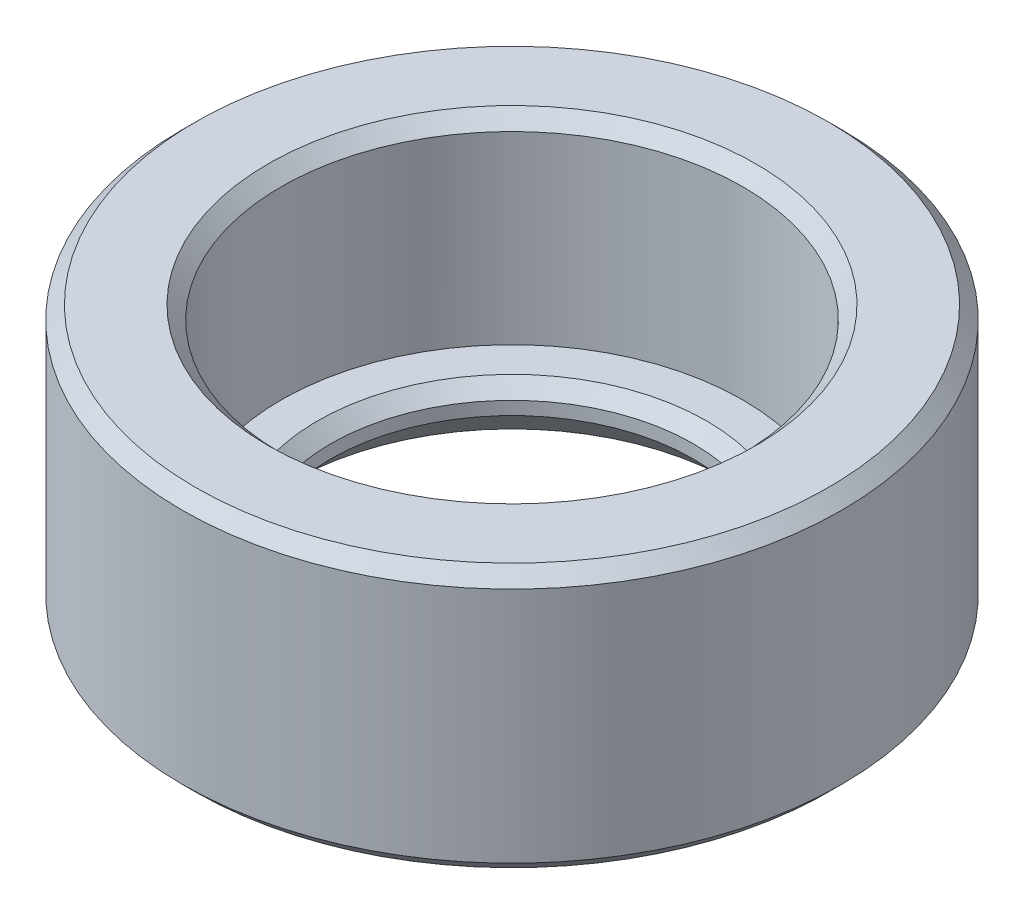
ISO-10303-21;
HEADER;
FILE_DESCRIPTION(('STEP AP214'),'2;1');
FILE_NAME('part.step','',(''),(''),'','','');
FILE_SCHEMA(('AUTOMOTIVE_DESIGN { 1 0 10303 214 1 1 1 1 }'));
ENDSEC;
DATA;
#1=APPLICATION_CONTEXT('core data for automotive mechanical design processes');
#2=APPLICATION_PROTOCOL_DEFINITION('international standard','automotive_design',2000,#1);
#3=PRODUCT_CONTEXT('',#1,'mechanical');
#4=PRODUCT('Part','Part','',(#3));
#5=PRODUCT_RELATED_PRODUCT_CATEGORY('part','',(#4));
#6=PRODUCT_DEFINITION_FORMATION('','',#4);
#7=PRODUCT_DEFINITION_CONTEXT('part definition',#1,'design');
#8=PRODUCT_DEFINITION('design','',#6,#7);
#9=PRODUCT_DEFINITION_SHAPE('','',#8);
#10=(LENGTH_UNIT() NAMED_UNIT(*) SI_UNIT(.MILLI.,.METRE.));
#11=(NAMED_UNIT(*) PLANE_ANGLE_UNIT() SI_UNIT($,.RADIAN.));
#12=(NAMED_UNIT(*) SI_UNIT($,.STERADIAN.) SOLID_ANGLE_UNIT());
#13=UNCERTAINTY_MEASURE_WITH_UNIT(LENGTH_MEASURE(1.E-05),#10,'distance_accuracy_value','');
#14=(GEOMETRIC_REPRESENTATION_CONTEXT(3) GLOBAL_UNCERTAINTY_ASSIGNED_CONTEXT((#13)) GLOBAL_UNIT_ASSIGNED_CONTEXT((#10,
#11,#12)) REPRESENTATION_CONTEXT('',''));
#15=CARTESIAN_POINT('',(0.,0.,0.));
#16=DIRECTION('',(0.,0.,1.));
#17=DIRECTION('',(1.,0.,0.));
#18=AXIS2_PLACEMENT_3D('',#15,#16,#17);
#19=CARTESIAN_POINT('',(0.,4.,0.));
#20=DIRECTION('',(0.,-1.,0.));
#21=DIRECTION('',(0.,0.,-1.));
#22=AXIS2_PLACEMENT_3D('',#19,#20,#21);
#23=CYLINDRICAL_SURFACE('',#22,3.5);
#24=CARTESIAN_POINT('',(0.,3.8,0.));
#25=DIRECTION('',(0.,1.,0.));
#26=DIRECTION('',(0.,0.,1.));
#27=AXIS2_PLACEMENT_3D('',#24,#25,#26);
#28=CIRCLE('',#27,3.5);
#29=CARTESIAN_POINT('',(0.,3.8,3.5));
#30=VERTEX_POINT('',#29);
#31=EDGE_CURVE('E55',#30,#30,#28,.T.);
#32=ORIENTED_EDGE('',*,*,#31,.T.);
#33=EDGE_LOOP('',(#32));
#34=FACE_BOUND('',#33,.T.);
#35=CARTESIAN_POINT('',(0.,1.,0.));
#36=DIRECTION('',(0.,-1.,0.));
#37=DIRECTION('',(0.,0.,-1.));
#38=AXIS2_PLACEMENT_3D('',#35,#36,#37);
#39=CIRCLE('',#38,3.5);
#40=CARTESIAN_POINT('',(0.,1.,-3.5));
#41=VERTEX_POINT('',#40);
#42=EDGE_CURVE('E91',#41,#41,#39,.T.);
#43=ORIENTED_EDGE('',*,*,#42,.T.);
#44=EDGE_LOOP('',(#43));
#45=FACE_BOUND('',#44,.T.);
#46=ADVANCED_FACE('F40',(#34,#45),#23,.F.);
#47=CARTESIAN_POINT('',(0.,4.,0.));
#48=DIRECTION('',(0.,1.,0.));
#49=DIRECTION('',(0.,0.,1.));
#50=AXIS2_PLACEMENT_3D('',#47,#48,#49);
#51=PLANE('',#50);
#52=CARTESIAN_POINT('',(0.,4.,0.));
#53=DIRECTION('',(0.,1.,0.));
#54=DIRECTION('',(0.,0.,1.));
#55=AXIS2_PLACEMENT_3D('',#52,#53,#54);
#56=CIRCLE('',#55,4.8);
#57=CARTESIAN_POINT('',(0.,4.,4.8));
#58=VERTEX_POINT('',#57);
#59=EDGE_CURVE('E61',#58,#58,#56,.T.);
#60=ORIENTED_EDGE('',*,*,#59,.T.);
#61=EDGE_LOOP('',(#60));
#62=FACE_BOUND('',#61,.T.);
#63=CARTESIAN_POINT('',(0.,4.,0.));
#64=DIRECTION('',(0.,1.,0.));
#65=DIRECTION('',(0.,0.,1.));
#66=AXIS2_PLACEMENT_3D('',#63,#64,#65);
#67=CIRCLE('',#66,3.7);
#68=CARTESIAN_POINT('',(0.,4.,3.7));
#69=VERTEX_POINT('',#68);
#70=EDGE_CURVE('E67',#69,#69,#67,.F.);
#71=ORIENTED_EDGE('',*,*,#70,.T.);
#72=EDGE_LOOP('',(#71));
#73=FACE_BOUND('',#72,.T.);
#74=ADVANCED_FACE('F115',(#62,#73),#51,.T.);
#75=CARTESIAN_POINT('',(0.,0.,0.));
#76=DIRECTION('',(0.,1.,0.));
#77=DIRECTION('',(0.,0.,1.));
#78=AXIS2_PLACEMENT_3D('',#75,#76,#77);
#79=PLANE('',#78);
#80=CARTESIAN_POINT('',(0.,0.,0.));
#81=DIRECTION('',(0.,1.,0.));
#82=DIRECTION('',(0.,0.,1.));
#83=AXIS2_PLACEMENT_3D('',#80,#81,#82);
#84=CIRCLE('',#83,3.35);
#85=CARTESIAN_POINT('',(0.,0.,3.35));
#86=VERTEX_POINT('',#85);
#87=EDGE_CURVE('E10',#86,#86,#84,.T.);
#88=ORIENTED_EDGE('',*,*,#87,.T.);
#89=EDGE_LOOP('',(#88));
#90=FACE_BOUND('',#89,.T.);
#91=CARTESIAN_POINT('',(0.,0.,0.));
#92=DIRECTION('',(0.,1.,0.));
#93=DIRECTION('',(0.,0.,1.));
#94=AXIS2_PLACEMENT_3D('',#91,#92,#93);
#95=CIRCLE('',#94,4.8);
#96=CARTESIAN_POINT('',(0.,0.,4.8));
#97=VERTEX_POINT('',#96);
#98=EDGE_CURVE('E71',#97,#97,#95,.F.);
#99=ORIENTED_EDGE('',*,*,#98,.T.);
#100=EDGE_LOOP('',(#99));
#101=FACE_BOUND('',#100,.T.);
#102=ADVANCED_FACE('F110',(#90,#101),#79,.F.);
#103=CARTESIAN_POINT('',(0.,4.,0.));
#104=DIRECTION('',(0.,-1.,0.));
#105=DIRECTION('',(0.,0.,-1.));
#106=AXIS2_PLACEMENT_3D('',#103,#104,#105);
#107=CYLINDRICAL_SURFACE('',#106,5.);
#108=CARTESIAN_POINT('',(0.,0.200000000000001,0.));
#109=DIRECTION('',(0.,1.,0.));
#110=DIRECTION('',(0.,0.,1.));
#111=AXIS2_PLACEMENT_3D('',#108,#109,#110);
#112=CIRCLE('',#111,5.);
#113=CARTESIAN_POINT('',(0.,0.200000000000001,5.));
#114=VERTEX_POINT('',#113);
#115=EDGE_CURVE('E75',#114,#114,#112,.T.);
#116=ORIENTED_EDGE('',*,*,#115,.T.);
#117=EDGE_LOOP('',(#116));
#118=FACE_BOUND('',#117,.T.);
#119=CARTESIAN_POINT('',(0.,3.8,0.));
#120=DIRECTION('',(0.,1.,0.));
#121=DIRECTION('',(0.,0.,1.));
#122=AXIS2_PLACEMENT_3D('',#119,#120,#121);
#123=CIRCLE('',#122,5.);
#124=CARTESIAN_POINT('',(0.,3.8,5.));
#125=VERTEX_POINT('',#124);
#126=EDGE_CURVE('E79',#125,#125,#123,.F.);
#127=ORIENTED_EDGE('',*,*,#126,.T.);
#128=EDGE_LOOP('',(#127));
#129=FACE_BOUND('',#128,.T.);
#130=ADVANCED_FACE('F101',(#118,#129),#107,.T.);
#131=CARTESIAN_POINT('',(0.,1.,0.));
#132=DIRECTION('',(0.,-1.,0.));
#133=DIRECTION('',(0.,0.,-1.));
#134=AXIS2_PLACEMENT_3D('',#131,#132,#133);
#135=PLANE('',#134);
#136=CARTESIAN_POINT('',(0.,1.,0.));
#137=DIRECTION('',(0.,-1.,0.));
#138=DIRECTION('',(0.,0.,-1.));
#139=AXIS2_PLACEMENT_3D('',#136,#137,#138);
#140=CIRCLE('',#139,2.95);
#141=CARTESIAN_POINT('',(0.,1.,-2.95));
#142=VERTEX_POINT('',#141);
#143=EDGE_CURVE('E87',#142,#142,#140,.T.);
#144=ORIENTED_EDGE('',*,*,#143,.T.);
#145=EDGE_LOOP('',(#144));
#146=FACE_BOUND('',#145,.T.);
#147=ORIENTED_EDGE('',*,*,#42,.F.);
#148=EDGE_LOOP('',(#147));
#149=FACE_BOUND('',#148,.T.);
#150=ADVANCED_FACE('F98',(#146,#149),#135,.F.);
#151=CARTESIAN_POINT('',(0.,1.,0.));
#152=DIRECTION('',(0.,-1.,0.));
#153=DIRECTION('',(0.,0.,-1.));
#154=AXIS2_PLACEMENT_3D('',#151,#152,#153);
#155=CYLINDRICAL_SURFACE('',#154,2.75);
#156=CARTESIAN_POINT('',(0.,0.599999999999998,0.));
#157=DIRECTION('',(0.,1.,0.));
#158=DIRECTION('',(0.,0.,1.));
#159=AXIS2_PLACEMENT_3D('',#156,#157,#158);
#160=CIRCLE('',#159,2.75);
#161=CARTESIAN_POINT('',(0.,0.599999999999998,2.75));
#162=VERTEX_POINT('',#161);
#163=EDGE_CURVE('E49',#162,#162,#160,.F.);
#164=ORIENTED_EDGE('',*,*,#163,.T.);
#165=EDGE_LOOP('',(#164));
#166=FACE_BOUND('',#165,.T.);
#167=CARTESIAN_POINT('',(0.,0.800000000000001,0.));
#168=DIRECTION('',(0.,-1.,0.));
#169=DIRECTION('',(0.,0.,-1.));
#170=AXIS2_PLACEMENT_3D('',#167,#168,#169);
#171=CIRCLE('',#170,2.75);
#172=CARTESIAN_POINT('',(0.,0.800000000000001,-2.75));
#173=VERTEX_POINT('',#172);
#174=EDGE_CURVE('E83',#173,#173,#171,.F.);
#175=ORIENTED_EDGE('',*,*,#174,.T.);
#176=EDGE_LOOP('',(#175));
#177=FACE_BOUND('',#176,.T.);
#178=ADVANCED_FACE('F100',(#166,#177),#155,.F.);
#179=CARTESIAN_POINT('',(0.,1.,0.));
#180=DIRECTION('',(0.,1.,0.));
#181=DIRECTION('',(0.,0.,1.));
#182=AXIS2_PLACEMENT_3D('',#179,#180,#181);
#183=CONICAL_SURFACE('',#182,2.95,0.785398163397448);
#184=ORIENTED_EDGE('',*,*,#174,.F.);
#185=EDGE_LOOP('',(#184));
#186=FACE_BOUND('',#185,.T.);
#187=ORIENTED_EDGE('',*,*,#143,.F.);
#188=EDGE_LOOP('',(#187));
#189=FACE_BOUND('',#188,.T.);
#190=ADVANCED_FACE('F108',(#186,#189),#183,.F.);
#191=CARTESIAN_POINT('',(0.,0.200000000000001,0.));
#192=DIRECTION('',(0.,1.,0.));
#193=DIRECTION('',(0.,0.,1.));
#194=AXIS2_PLACEMENT_3D('',#191,#192,#193);
#195=CONICAL_SURFACE('',#194,5.,0.785398163397448);
#196=ORIENTED_EDGE('',*,*,#98,.F.);
#197=EDGE_LOOP('',(#196));
#198=FACE_BOUND('',#197,.T.);
#199=ORIENTED_EDGE('',*,*,#115,.F.);
#200=EDGE_LOOP('',(#199));
#201=FACE_BOUND('',#200,.T.);
#202=ADVANCED_FACE('F131',(#198,#201),#195,.T.);
#203=CARTESIAN_POINT('',(0.,4.,0.));
#204=DIRECTION('',(0.,-1.,0.));
#205=DIRECTION('',(0.,0.,-1.));
#206=AXIS2_PLACEMENT_3D('',#203,#204,#205);
#207=CONICAL_SURFACE('',#206,4.8,0.785398163397442);
#208=ORIENTED_EDGE('',*,*,#126,.F.);
#209=EDGE_LOOP('',(#208));
#210=FACE_BOUND('',#209,.T.);
#211=ORIENTED_EDGE('',*,*,#59,.F.);
#212=EDGE_LOOP('',(#211));
#213=FACE_BOUND('',#212,.T.);
#214=ADVANCED_FACE('F138',(#210,#213),#207,.T.);
#215=CARTESIAN_POINT('',(0.,3.8,0.));
#216=DIRECTION('',(0.,1.,0.));
#217=DIRECTION('',(0.,0.,1.));
#218=AXIS2_PLACEMENT_3D('',#215,#216,#217);
#219=CONICAL_SURFACE('',#218,3.5,0.785398163397454);
#220=ORIENTED_EDGE('',*,*,#70,.F.);
#221=EDGE_LOOP('',(#220));
#222=FACE_BOUND('',#221,.T.);
#223=ORIENTED_EDGE('',*,*,#31,.F.);
#224=EDGE_LOOP('',(#223));
#225=FACE_BOUND('',#224,.T.);
#226=ADVANCED_FACE('F144',(#222,#225),#219,.F.);
#227=CARTESIAN_POINT('',(0.,0.599999999999998,0.));
#228=DIRECTION('',(0.,-1.,0.));
#229=DIRECTION('',(0.,0.,-1.));
#230=AXIS2_PLACEMENT_3D('',#227,#228,#229);
#231=CONICAL_SURFACE('',#230,2.75,0.78539816339745);
#232=ORIENTED_EDGE('',*,*,#87,.F.);
#233=EDGE_LOOP('',(#232));
#234=FACE_BOUND('',#233,.T.);
#235=ORIENTED_EDGE('',*,*,#163,.F.);
#236=EDGE_LOOP('',(#235));
#237=FACE_BOUND('',#236,.T.);
#238=ADVANCED_FACE('F43',(#234,#237),#231,.F.);
#239=CLOSED_SHELL('',(#46,#74,#102,#130,#150,#178,#190,#202,#214,#226,#238));
#240=MANIFOLD_SOLID_BREP('B2',#239);
#241=ADVANCED_BREP_SHAPE_REPRESENTATION('',(#18,#240),#14);
#242=SHAPE_DEFINITION_REPRESENTATION(#9,#241);
ENDSEC;
END-ISO-10303-21;
